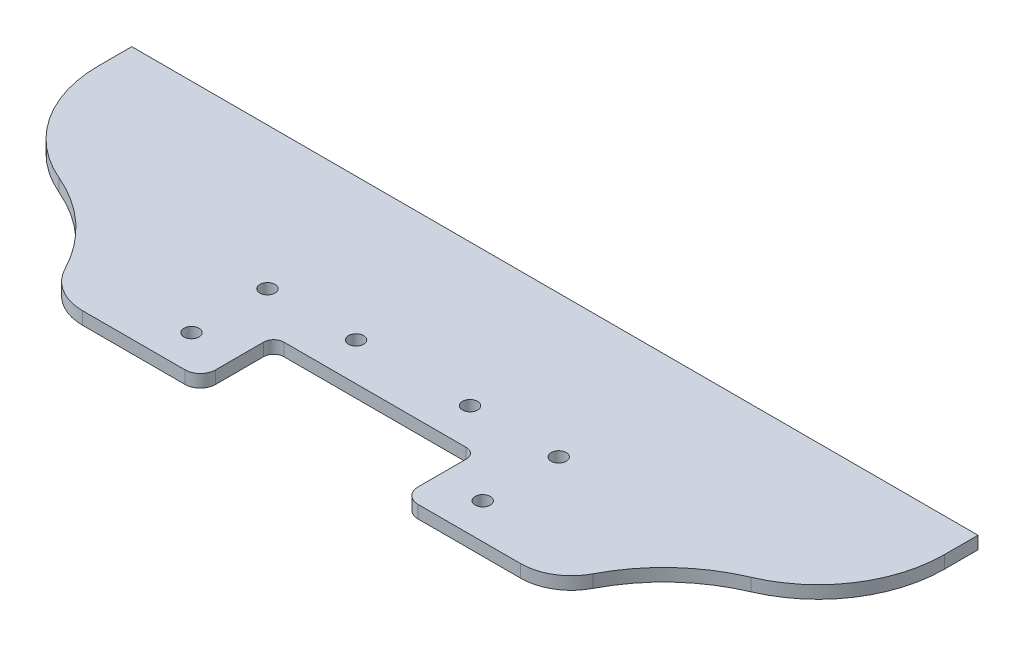
ISO-10303-21;
HEADER;
FILE_DESCRIPTION(('STEP AP214'),'2;1');
FILE_NAME('part.step','',(''),(''),'','','');
FILE_SCHEMA(('AUTOMOTIVE_DESIGN { 1 0 10303 214 1 1 1 1 }'));
ENDSEC;
DATA;
#1=APPLICATION_CONTEXT('core data for automotive mechanical design processes');
#2=APPLICATION_PROTOCOL_DEFINITION('international standard','automotive_design',2000,#1);
#3=PRODUCT_CONTEXT('',#1,'mechanical');
#4=PRODUCT('Part','Part','',(#3));
#5=PRODUCT_RELATED_PRODUCT_CATEGORY('part','',(#4));
#6=PRODUCT_DEFINITION_FORMATION('','',#4);
#7=PRODUCT_DEFINITION_CONTEXT('part definition',#1,'design');
#8=PRODUCT_DEFINITION('design','',#6,#7);
#9=PRODUCT_DEFINITION_SHAPE('','',#8);
#10=(LENGTH_UNIT() NAMED_UNIT(*) SI_UNIT(.MILLI.,.METRE.));
#11=(NAMED_UNIT(*) PLANE_ANGLE_UNIT() SI_UNIT($,.RADIAN.));
#12=(NAMED_UNIT(*) SI_UNIT($,.STERADIAN.) SOLID_ANGLE_UNIT());
#13=UNCERTAINTY_MEASURE_WITH_UNIT(LENGTH_MEASURE(1.E-05),#10,'distance_accuracy_value','');
#14=(GEOMETRIC_REPRESENTATION_CONTEXT(3) GLOBAL_UNCERTAINTY_ASSIGNED_CONTEXT((#13)) GLOBAL_UNIT_ASSIGNED_CONTEXT((#10,
#11,#12)) REPRESENTATION_CONTEXT('',''));
#15=CARTESIAN_POINT('',(0.,0.,0.));
#16=DIRECTION('',(0.,0.,1.));
#17=DIRECTION('',(1.,0.,0.));
#18=AXIS2_PLACEMENT_3D('',#15,#16,#17);
#19=CARTESIAN_POINT('',(-102.892624920902,3.175,35.5825031396323));
#20=DIRECTION('',(0.,-1.,0.));
#21=DIRECTION('',(0.,0.,-1.));
#22=AXIS2_PLACEMENT_3D('',#19,#20,#21);
#23=CYLINDRICAL_SURFACE('',#22,41.2975031396323);
#24=DIRECTION('',(0.,1.,0.));
#25=VECTOR('',#24,1.);
#26=CARTESIAN_POINT('',(-86.7504328122766,3.175,-2.4295133748354));
#27=LINE('',#26,#25);
#28=CARTESIAN_POINT('',(-86.7504328122766,0.,-2.4295133748354));
#29=VERTEX_POINT('',#28);
#30=CARTESIAN_POINT('',(-86.7504328122766,3.175,-2.4295133748354));
#31=VERTEX_POINT('',#30);
#32=EDGE_CURVE('E11',#29,#31,#27,.T.);
#33=ORIENTED_EDGE('',*,*,#32,.F.);
#34=CARTESIAN_POINT('',(-102.892624920902,0.,35.5825031396323));
#35=DIRECTION('',(0.,-1.,0.));
#36=DIRECTION('',(0.,0.,-1.));
#37=AXIS2_PLACEMENT_3D('',#34,#35,#36);
#38=CIRCLE('',#37,41.2975031396323);
#39=CARTESIAN_POINT('',(-66.2034722475201,0.,16.6249230810596));
#40=VERTEX_POINT('',#39);
#41=EDGE_CURVE('E135',#29,#40,#38,.T.);
#42=ORIENTED_EDGE('',*,*,#41,.T.);
#43=DIRECTION('',(0.,1.,0.));
#44=VECTOR('',#43,1.);
#45=CARTESIAN_POINT('',(-66.2034722475201,3.175,16.6249230810596));
#46=LINE('',#45,#44);
#47=CARTESIAN_POINT('',(-66.2034722475201,3.175,16.6249230810596));
#48=VERTEX_POINT('',#47);
#49=EDGE_CURVE('E48',#40,#48,#46,.T.);
#50=ORIENTED_EDGE('',*,*,#49,.T.);
#51=CARTESIAN_POINT('',(-102.892624920902,3.175,35.5825031396323));
#52=DIRECTION('',(0.,-1.,0.));
#53=DIRECTION('',(0.,0.,1.));
#54=AXIS2_PLACEMENT_3D('',#51,#52,#53);
#55=CIRCLE('',#54,41.2975031396323);
#56=EDGE_CURVE('E237',#31,#48,#55,.T.);
#57=ORIENTED_EDGE('',*,*,#56,.F.);
#58=EDGE_LOOP('',(#33,#42,#50,#57));
#59=FACE_BOUND('',#58,.T.);
#60=ADVANCED_FACE('F38',(#59),#23,.F.);
#61=CARTESIAN_POINT('',(-54.9206535895371,3.175,10.795));
#62=DIRECTION('',(0.,-1.,0.));
#63=DIRECTION('',(0.,0.,-1.));
#64=AXIS2_PLACEMENT_3D('',#61,#62,#63);
#65=CYLINDRICAL_SURFACE('',#64,12.7);
#66=ORIENTED_EDGE('',*,*,#49,.F.);
#67=CARTESIAN_POINT('',(-54.9206535895371,0.,10.795));
#68=DIRECTION('',(0.,-1.,0.));
#69=DIRECTION('',(0.,0.,-1.));
#70=AXIS2_PLACEMENT_3D('',#67,#68,#69);
#71=CIRCLE('',#70,12.7);
#72=CARTESIAN_POINT('',(-54.9206535895371,0.,23.495));
#73=VERTEX_POINT('',#72);
#74=EDGE_CURVE('E187',#40,#73,#71,.F.);
#75=ORIENTED_EDGE('',*,*,#74,.T.);
#76=DIRECTION('',(0.,1.,0.));
#77=VECTOR('',#76,1.);
#78=CARTESIAN_POINT('',(-54.9206535895371,3.175,23.495));
#79=LINE('',#78,#77);
#80=CARTESIAN_POINT('',(-54.9206535895371,3.175,23.495));
#81=VERTEX_POINT('',#80);
#82=EDGE_CURVE('E230',#73,#81,#79,.T.);
#83=ORIENTED_EDGE('',*,*,#82,.T.);
#84=CARTESIAN_POINT('',(-54.9206535895371,3.175,10.795));
#85=DIRECTION('',(0.,-1.,0.));
#86=DIRECTION('',(0.,0.,-1.));
#87=AXIS2_PLACEMENT_3D('',#84,#85,#86);
#88=CIRCLE('',#87,12.7);
#89=EDGE_CURVE('E246',#48,#81,#88,.F.);
#90=ORIENTED_EDGE('',*,*,#89,.F.);
#91=EDGE_LOOP('',(#66,#75,#83,#90));
#92=FACE_BOUND('',#91,.T.);
#93=ADVANCED_FACE('F249',(#92),#65,.T.);
#94=CARTESIAN_POINT('',(-104.775,3.175,23.495));
#95=DIRECTION('',(0.,0.,1.));
#96=DIRECTION('',(-1.,0.,0.));
#97=AXIS2_PLACEMENT_3D('',#94,#95,#96);
#98=PLANE('',#97);
#99=ORIENTED_EDGE('',*,*,#82,.F.);
#100=DIRECTION('',(1.,0.,0.));
#101=VECTOR('',#100,1.);
#102=CARTESIAN_POINT('',(0.,0.,23.495));
#103=LINE('',#102,#101);
#104=CARTESIAN_POINT('',(-29.21,0.,23.495));
#105=VERTEX_POINT('',#104);
#106=EDGE_CURVE('E184',#105,#73,#103,.F.);
#107=ORIENTED_EDGE('',*,*,#106,.F.);
#108=DIRECTION('',(0.,1.,0.));
#109=VECTOR('',#108,1.);
#110=CARTESIAN_POINT('',(-29.21,3.175,23.495));
#111=LINE('',#110,#109);
#112=CARTESIAN_POINT('',(-29.21,3.175,23.495));
#113=VERTEX_POINT('',#112);
#114=EDGE_CURVE('E227',#105,#113,#111,.T.);
#115=ORIENTED_EDGE('',*,*,#114,.T.);
#116=DIRECTION('',(-1.,0.,0.));
#117=VECTOR('',#116,1.);
#118=CARTESIAN_POINT('',(-104.775,3.175,23.495));
#119=LINE('',#118,#117);
#120=EDGE_CURVE('E250',#113,#81,#119,.T.);
#121=ORIENTED_EDGE('',*,*,#120,.T.);
#122=EDGE_LOOP('',(#99,#107,#115,#121));
#123=FACE_BOUND('',#122,.T.);
#124=ADVANCED_FACE('F327',(#123),#98,.T.);
#125=CARTESIAN_POINT('',(-29.21,3.175,19.685));
#126=DIRECTION('',(0.,-1.,0.));
#127=DIRECTION('',(0.,0.,-1.));
#128=AXIS2_PLACEMENT_3D('',#125,#126,#127);
#129=CYLINDRICAL_SURFACE('',#128,3.81);
#130=ORIENTED_EDGE('',*,*,#114,.F.);
#131=CARTESIAN_POINT('',(-29.21,0.,19.685));
#132=DIRECTION('',(0.,-1.,0.));
#133=DIRECTION('',(0.,0.,-1.));
#134=AXIS2_PLACEMENT_3D('',#131,#132,#133);
#135=CIRCLE('',#134,3.81);
#136=CARTESIAN_POINT('',(-25.4,0.,19.685));
#137=VERTEX_POINT('',#136);
#138=EDGE_CURVE('E181',#105,#137,#135,.F.);
#139=ORIENTED_EDGE('',*,*,#138,.T.);
#140=DIRECTION('',(0.,1.,0.));
#141=VECTOR('',#140,1.);
#142=CARTESIAN_POINT('',(-25.4,3.175,19.685));
#143=LINE('',#142,#141);
#144=CARTESIAN_POINT('',(-25.4,3.175,19.685));
#145=VERTEX_POINT('',#144);
#146=EDGE_CURVE('E224',#137,#145,#143,.T.);
#147=ORIENTED_EDGE('',*,*,#146,.T.);
#148=CARTESIAN_POINT('',(-29.21,3.175,19.685));
#149=DIRECTION('',(0.,-1.,0.));
#150=DIRECTION('',(0.,0.,-1.));
#151=AXIS2_PLACEMENT_3D('',#148,#149,#150);
#152=CIRCLE('',#151,3.81);
#153=EDGE_CURVE('E252',#113,#145,#152,.F.);
#154=ORIENTED_EDGE('',*,*,#153,.F.);
#155=EDGE_LOOP('',(#130,#139,#147,#154));
#156=FACE_BOUND('',#155,.T.);
#157=ADVANCED_FACE('F330',(#156),#129,.T.);
#158=CARTESIAN_POINT('',(-25.4,3.175,5.07999999999999));
#159=DIRECTION('',(1.,0.,0.));
#160=DIRECTION('',(0.,0.,1.));
#161=AXIS2_PLACEMENT_3D('',#158,#159,#160);
#162=PLANE('',#161);
#163=ORIENTED_EDGE('',*,*,#146,.F.);
#164=DIRECTION('',(0.,0.,-1.));
#165=VECTOR('',#164,1.);
#166=CARTESIAN_POINT('',(-25.4,0.,0.));
#167=LINE('',#166,#165);
#168=CARTESIAN_POINT('',(-25.4,0.,7.61999999999999));
#169=VERTEX_POINT('',#168);
#170=EDGE_CURVE('E178',#169,#137,#167,.F.);
#171=ORIENTED_EDGE('',*,*,#170,.F.);
#172=DIRECTION('',(0.,1.,0.));
#173=VECTOR('',#172,1.);
#174=CARTESIAN_POINT('',(-25.4,3.175,7.61999999999999));
#175=LINE('',#174,#173);
#176=CARTESIAN_POINT('',(-25.4,3.175,7.61999999999999));
#177=VERTEX_POINT('',#176);
#178=EDGE_CURVE('E221',#169,#177,#175,.T.);
#179=ORIENTED_EDGE('',*,*,#178,.T.);
#180=DIRECTION('',(0.,0.,1.));
#181=VECTOR('',#180,1.);
#182=CARTESIAN_POINT('',(-25.4,3.175,5.07999999999999));
#183=LINE('',#182,#181);
#184=EDGE_CURVE('E259',#177,#145,#183,.T.);
#185=ORIENTED_EDGE('',*,*,#184,.T.);
#186=EDGE_LOOP('',(#163,#171,#179,#185));
#187=FACE_BOUND('',#186,.T.);
#188=ADVANCED_FACE('F333',(#187),#162,.T.);
#189=CARTESIAN_POINT('',(-22.86,3.175,7.61999999999999));
#190=DIRECTION('',(0.,-1.,0.));
#191=DIRECTION('',(0.,0.,-1.));
#192=AXIS2_PLACEMENT_3D('',#189,#190,#191);
#193=CYLINDRICAL_SURFACE('',#192,2.54);
#194=ORIENTED_EDGE('',*,*,#178,.F.);
#195=CARTESIAN_POINT('',(-22.86,0.,7.61999999999999));
#196=DIRECTION('',(0.,-1.,0.));
#197=DIRECTION('',(0.,0.,-1.));
#198=AXIS2_PLACEMENT_3D('',#195,#196,#197);
#199=CIRCLE('',#198,2.54);
#200=CARTESIAN_POINT('',(-22.86,0.,5.07999999999999));
#201=VERTEX_POINT('',#200);
#202=EDGE_CURVE('E175',#169,#201,#199,.T.);
#203=ORIENTED_EDGE('',*,*,#202,.T.);
#204=DIRECTION('',(0.,1.,0.));
#205=VECTOR('',#204,1.);
#206=CARTESIAN_POINT('',(-22.86,3.175,5.07999999999999));
#207=LINE('',#206,#205);
#208=CARTESIAN_POINT('',(-22.86,3.175,5.07999999999999));
#209=VERTEX_POINT('',#208);
#210=EDGE_CURVE('E218',#201,#209,#207,.T.);
#211=ORIENTED_EDGE('',*,*,#210,.T.);
#212=CARTESIAN_POINT('',(-22.86,3.175,7.61999999999999));
#213=DIRECTION('',(0.,-1.,0.));
#214=DIRECTION('',(0.,0.,-1.));
#215=AXIS2_PLACEMENT_3D('',#212,#213,#214);
#216=CIRCLE('',#215,2.54);
#217=EDGE_CURVE('E262',#177,#209,#216,.T.);
#218=ORIENTED_EDGE('',*,*,#217,.F.);
#219=EDGE_LOOP('',(#194,#203,#211,#218));
#220=FACE_BOUND('',#219,.T.);
#221=ADVANCED_FACE('F337',(#220),#193,.F.);
#222=CARTESIAN_POINT('',(-25.4,3.175,5.07999999999999));
#223=DIRECTION('',(0.,0.,1.));
#224=DIRECTION('',(-1.,0.,0.));
#225=AXIS2_PLACEMENT_3D('',#222,#223,#224);
#226=PLANE('',#225);
#227=ORIENTED_EDGE('',*,*,#210,.F.);
#228=DIRECTION('',(1.,0.,0.));
#229=VECTOR('',#228,1.);
#230=CARTESIAN_POINT('',(0.,0.,5.07999999999999));
#231=LINE('',#230,#229);
#232=CARTESIAN_POINT('',(22.86,0.,5.07999999999999));
#233=VERTEX_POINT('',#232);
#234=EDGE_CURVE('E172',#233,#201,#231,.F.);
#235=ORIENTED_EDGE('',*,*,#234,.F.);
#236=DIRECTION('',(0.,1.,0.));
#237=VECTOR('',#236,1.);
#238=CARTESIAN_POINT('',(22.86,3.175,5.07999999999999));
#239=LINE('',#238,#237);
#240=CARTESIAN_POINT('',(22.86,3.175,5.07999999999999));
#241=VERTEX_POINT('',#240);
#242=EDGE_CURVE('E215',#233,#241,#239,.T.);
#243=ORIENTED_EDGE('',*,*,#242,.T.);
#244=DIRECTION('',(-1.,0.,0.));
#245=VECTOR('',#244,1.);
#246=CARTESIAN_POINT('',(-25.4,3.175,5.07999999999999));
#247=LINE('',#246,#245);
#248=EDGE_CURVE('E265',#241,#209,#247,.T.);
#249=ORIENTED_EDGE('',*,*,#248,.T.);
#250=EDGE_LOOP('',(#227,#235,#243,#249));
#251=FACE_BOUND('',#250,.T.);
#252=ADVANCED_FACE('F341',(#251),#226,.T.);
#253=CARTESIAN_POINT('',(22.86,3.175,7.61999999999999));
#254=DIRECTION('',(0.,-1.,0.));
#255=DIRECTION('',(0.,0.,-1.));
#256=AXIS2_PLACEMENT_3D('',#253,#254,#255);
#257=CYLINDRICAL_SURFACE('',#256,2.54);
#258=ORIENTED_EDGE('',*,*,#242,.F.);
#259=CARTESIAN_POINT('',(22.86,0.,7.61999999999999));
#260=DIRECTION('',(0.,-1.,0.));
#261=DIRECTION('',(0.,0.,-1.));
#262=AXIS2_PLACEMENT_3D('',#259,#260,#261);
#263=CIRCLE('',#262,2.54);
#264=CARTESIAN_POINT('',(25.4,0.,7.61999999999999));
#265=VERTEX_POINT('',#264);
#266=EDGE_CURVE('E169',#233,#265,#263,.T.);
#267=ORIENTED_EDGE('',*,*,#266,.T.);
#268=DIRECTION('',(0.,1.,0.));
#269=VECTOR('',#268,1.);
#270=CARTESIAN_POINT('',(25.4,3.175,7.61999999999999));
#271=LINE('',#270,#269);
#272=CARTESIAN_POINT('',(25.4,3.175,7.61999999999999));
#273=VERTEX_POINT('',#272);
#274=EDGE_CURVE('E212',#265,#273,#271,.T.);
#275=ORIENTED_EDGE('',*,*,#274,.T.);
#276=CARTESIAN_POINT('',(22.86,3.175,7.61999999999999));
#277=DIRECTION('',(0.,-1.,0.));
#278=DIRECTION('',(0.,0.,-1.));
#279=AXIS2_PLACEMENT_3D('',#276,#277,#278);
#280=CIRCLE('',#279,2.54);
#281=EDGE_CURVE('E268',#241,#273,#280,.T.);
#282=ORIENTED_EDGE('',*,*,#281,.F.);
#283=EDGE_LOOP('',(#258,#267,#275,#282));
#284=FACE_BOUND('',#283,.T.);
#285=ADVANCED_FACE('F345',(#284),#257,.F.);
#286=CARTESIAN_POINT('',(25.4,3.175,5.07999999999999));
#287=DIRECTION('',(-1.,0.,0.));
#288=DIRECTION('',(0.,0.,-1.));
#289=AXIS2_PLACEMENT_3D('',#286,#287,#288);
#290=PLANE('',#289);
#291=ORIENTED_EDGE('',*,*,#274,.F.);
#292=DIRECTION('',(0.,0.,-1.));
#293=VECTOR('',#292,1.);
#294=CARTESIAN_POINT('',(25.4,0.,0.));
#295=LINE('',#294,#293);
#296=CARTESIAN_POINT('',(25.4,0.,19.685));
#297=VERTEX_POINT('',#296);
#298=EDGE_CURVE('E166',#297,#265,#295,.T.);
#299=ORIENTED_EDGE('',*,*,#298,.F.);
#300=DIRECTION('',(0.,1.,0.));
#301=VECTOR('',#300,1.);
#302=CARTESIAN_POINT('',(25.4,3.175,19.685));
#303=LINE('',#302,#301);
#304=CARTESIAN_POINT('',(25.4,3.175,19.685));
#305=VERTEX_POINT('',#304);
#306=EDGE_CURVE('E209',#297,#305,#303,.T.);
#307=ORIENTED_EDGE('',*,*,#306,.T.);
#308=DIRECTION('',(0.,0.,-1.));
#309=VECTOR('',#308,1.);
#310=CARTESIAN_POINT('',(25.4,3.175,5.07999999999999));
#311=LINE('',#310,#309);
#312=EDGE_CURVE('E271',#305,#273,#311,.T.);
#313=ORIENTED_EDGE('',*,*,#312,.T.);
#314=EDGE_LOOP('',(#291,#299,#307,#313));
#315=FACE_BOUND('',#314,.T.);
#316=ADVANCED_FACE('F349',(#315),#290,.T.);
#317=CARTESIAN_POINT('',(29.21,3.175,19.685));
#318=DIRECTION('',(0.,-1.,0.));
#319=DIRECTION('',(0.,0.,-1.));
#320=AXIS2_PLACEMENT_3D('',#317,#318,#319);
#321=CYLINDRICAL_SURFACE('',#320,3.81);
#322=ORIENTED_EDGE('',*,*,#306,.F.);
#323=CARTESIAN_POINT('',(29.21,0.,19.685));
#324=DIRECTION('',(0.,-1.,0.));
#325=DIRECTION('',(0.,0.,-1.));
#326=AXIS2_PLACEMENT_3D('',#323,#324,#325);
#327=CIRCLE('',#326,3.81);
#328=CARTESIAN_POINT('',(29.21,0.,23.495));
#329=VERTEX_POINT('',#328);
#330=EDGE_CURVE('E163',#297,#329,#327,.F.);
#331=ORIENTED_EDGE('',*,*,#330,.T.);
#332=DIRECTION('',(0.,1.,0.));
#333=VECTOR('',#332,1.);
#334=CARTESIAN_POINT('',(29.21,3.175,23.495));
#335=LINE('',#334,#333);
#336=CARTESIAN_POINT('',(29.21,3.175,23.495));
#337=VERTEX_POINT('',#336);
#338=EDGE_CURVE('E206',#329,#337,#335,.T.);
#339=ORIENTED_EDGE('',*,*,#338,.T.);
#340=CARTESIAN_POINT('',(29.21,3.175,19.685));
#341=DIRECTION('',(0.,-1.,0.));
#342=DIRECTION('',(0.,0.,-1.));
#343=AXIS2_PLACEMENT_3D('',#340,#341,#342);
#344=CIRCLE('',#343,3.81);
#345=EDGE_CURVE('E274',#305,#337,#344,.F.);
#346=ORIENTED_EDGE('',*,*,#345,.F.);
#347=EDGE_LOOP('',(#322,#331,#339,#346));
#348=FACE_BOUND('',#347,.T.);
#349=ADVANCED_FACE('F353',(#348),#321,.T.);
#350=ORIENTED_EDGE('',*,*,#338,.F.);
#351=DIRECTION('',(1.,0.,0.));
#352=VECTOR('',#351,1.);
#353=CARTESIAN_POINT('',(0.,0.,23.495));
#354=LINE('',#353,#352);
#355=CARTESIAN_POINT('',(54.9206535895371,0.,23.495));
#356=VERTEX_POINT('',#355);
#357=EDGE_CURVE('E160',#356,#329,#354,.F.);
#358=ORIENTED_EDGE('',*,*,#357,.F.);
#359=DIRECTION('',(0.,1.,0.));
#360=VECTOR('',#359,1.);
#361=CARTESIAN_POINT('',(54.9206535895371,3.175,23.495));
#362=LINE('',#361,#360);
#363=CARTESIAN_POINT('',(54.9206535895371,3.175,23.495));
#364=VERTEX_POINT('',#363);
#365=EDGE_CURVE('E203',#356,#364,#362,.T.);
#366=ORIENTED_EDGE('',*,*,#365,.T.);
#367=EDGE_CURVE('E254',#364,#337,#119,.T.);
#368=ORIENTED_EDGE('',*,*,#367,.T.);
#369=EDGE_LOOP('',(#350,#358,#366,#368));
#370=FACE_BOUND('',#369,.T.);
#371=ADVANCED_FACE('F357',(#370),#98,.T.);
#372=CARTESIAN_POINT('',(54.9206535895371,3.175,10.795));
#373=DIRECTION('',(0.,-1.,0.));
#374=DIRECTION('',(0.,0.,-1.));
#375=AXIS2_PLACEMENT_3D('',#372,#373,#374);
#376=CYLINDRICAL_SURFACE('',#375,12.7);
#377=ORIENTED_EDGE('',*,*,#365,.F.);
#378=CARTESIAN_POINT('',(54.9206535895371,0.,10.795));
#379=DIRECTION('',(0.,-1.,0.));
#380=DIRECTION('',(0.,0.,-1.));
#381=AXIS2_PLACEMENT_3D('',#378,#379,#380);
#382=CIRCLE('',#381,12.7);
#383=CARTESIAN_POINT('',(66.2034722475201,0.,16.6249230810596));
#384=VERTEX_POINT('',#383);
#385=EDGE_CURVE('E157',#356,#384,#382,.F.);
#386=ORIENTED_EDGE('',*,*,#385,.T.);
#387=DIRECTION('',(0.,1.,0.));
#388=VECTOR('',#387,1.);
#389=CARTESIAN_POINT('',(66.2034722475201,3.175,16.6249230810596));
#390=LINE('',#389,#388);
#391=CARTESIAN_POINT('',(66.2034722475201,3.175,16.6249230810596));
#392=VERTEX_POINT('',#391);
#393=EDGE_CURVE('E200',#384,#392,#390,.T.);
#394=ORIENTED_EDGE('',*,*,#393,.T.);
#395=CARTESIAN_POINT('',(54.9206535895371,3.175,10.795));
#396=DIRECTION('',(0.,-1.,0.));
#397=DIRECTION('',(0.,0.,-1.));
#398=AXIS2_PLACEMENT_3D('',#395,#396,#397);
#399=CIRCLE('',#398,12.7);
#400=EDGE_CURVE('E277',#364,#392,#399,.F.);
#401=ORIENTED_EDGE('',*,*,#400,.F.);
#402=EDGE_LOOP('',(#377,#386,#394,#401));
#403=FACE_BOUND('',#402,.T.);
#404=ADVANCED_FACE('F361',(#403),#376,.T.);
#405=CARTESIAN_POINT('',(102.892624920902,3.175,35.5825031396323));
#406=DIRECTION('',(0.,-1.,0.));
#407=DIRECTION('',(0.,0.,-1.));
#408=AXIS2_PLACEMENT_3D('',#405,#406,#407);
#409=CYLINDRICAL_SURFACE('',#408,41.2975031396323);
#410=ORIENTED_EDGE('',*,*,#393,.F.);
#411=CARTESIAN_POINT('',(102.892624920902,0.,35.5825031396323));
#412=DIRECTION('',(0.,1.,0.));
#413=DIRECTION('',(0.,0.,1.));
#414=AXIS2_PLACEMENT_3D('',#411,#412,#413);
#415=CIRCLE('',#414,41.2975031396323);
#416=CARTESIAN_POINT('',(86.7504328122766,0.,-2.4295133748354));
#417=VERTEX_POINT('',#416);
#418=EDGE_CURVE('E154',#417,#384,#415,.T.);
#419=ORIENTED_EDGE('',*,*,#418,.F.);
#420=DIRECTION('',(0.,1.,0.));
#421=VECTOR('',#420,1.);
#422=CARTESIAN_POINT('',(86.7504328122766,3.175,-2.4295133748354));
#423=LINE('',#422,#421);
#424=CARTESIAN_POINT('',(86.7504328122766,3.175,-2.4295133748354));
#425=VERTEX_POINT('',#424);
#426=EDGE_CURVE('E197',#417,#425,#423,.T.);
#427=ORIENTED_EDGE('',*,*,#426,.T.);
#428=CARTESIAN_POINT('',(102.892624920902,3.175,35.5825031396323));
#429=DIRECTION('',(0.,1.,0.));
#430=DIRECTION('',(0.,0.,1.));
#431=AXIS2_PLACEMENT_3D('',#428,#429,#430);
#432=CIRCLE('',#431,41.2975031396323);
#433=EDGE_CURVE('E280',#425,#392,#432,.T.);
#434=ORIENTED_EDGE('',*,*,#433,.T.);
#435=EDGE_LOOP('',(#410,#419,#427,#434));
#436=FACE_BOUND('',#435,.T.);
#437=ADVANCED_FACE('F365',(#436),#409,.F.);
#438=CARTESIAN_POINT('',(74.3401280605345,3.175,-31.6535931031842));
#439=DIRECTION('',(0.,-1.,0.));
#440=DIRECTION('',(0.,0.,-1.));
#441=AXIS2_PLACEMENT_3D('',#438,#439,#440);
#442=CYLINDRICAL_SURFACE('',#441,31.75);
#443=ORIENTED_EDGE('',*,*,#426,.F.);
#444=CARTESIAN_POINT('',(74.3401280605345,0.,-31.6535931031842));
#445=DIRECTION('',(0.,-1.,0.));
#446=DIRECTION('',(0.,0.,-1.));
#447=AXIS2_PLACEMENT_3D('',#444,#445,#446);
#448=CIRCLE('',#447,31.75);
#449=CARTESIAN_POINT('',(106.090128060535,0.,-31.6535931031842));
#450=VERTEX_POINT('',#449);
#451=EDGE_CURVE('E151',#417,#450,#448,.F.);
#452=ORIENTED_EDGE('',*,*,#451,.T.);
#453=DIRECTION('',(0.,1.,0.));
#454=VECTOR('',#453,1.);
#455=CARTESIAN_POINT('',(106.090128060535,3.175,-31.6535931031842));
#456=LINE('',#455,#454);
#457=CARTESIAN_POINT('',(106.090128060535,3.175,-31.6535931031842));
#458=VERTEX_POINT('',#457);
#459=EDGE_CURVE('E194',#450,#458,#456,.T.);
#460=ORIENTED_EDGE('',*,*,#459,.T.);
#461=CARTESIAN_POINT('',(74.3401280605345,3.175,-31.6535931031842));
#462=DIRECTION('',(0.,-1.,0.));
#463=DIRECTION('',(0.,0.,-1.));
#464=AXIS2_PLACEMENT_3D('',#461,#462,#463);
#465=CIRCLE('',#464,31.75);
#466=EDGE_CURVE('E283',#425,#458,#465,.F.);
#467=ORIENTED_EDGE('',*,*,#466,.F.);
#468=EDGE_LOOP('',(#443,#452,#460,#467));
#469=FACE_BOUND('',#468,.T.);
#470=ADVANCED_FACE('F369',(#469),#442,.T.);
#471=CARTESIAN_POINT('',(106.090128060535,3.175,23.495));
#472=DIRECTION('',(-1.,0.,0.));
#473=DIRECTION('',(0.,0.,-1.));
#474=AXIS2_PLACEMENT_3D('',#471,#472,#473);
#475=PLANE('',#474);
#476=ORIENTED_EDGE('',*,*,#459,.F.);
#477=DIRECTION('',(0.,0.,-1.));
#478=VECTOR('',#477,1.);
#479=CARTESIAN_POINT('',(106.090128060535,0.,0.));
#480=LINE('',#479,#478);
#481=CARTESIAN_POINT('',(106.090128060535,0.,-40.005));
#482=VERTEX_POINT('',#481);
#483=EDGE_CURVE('E148',#450,#482,#480,.T.);
#484=ORIENTED_EDGE('',*,*,#483,.T.);
#485=DIRECTION('',(0.,1.,0.));
#486=VECTOR('',#485,1.);
#487=CARTESIAN_POINT('',(106.090128060535,3.175,-40.005));
#488=LINE('',#487,#486);
#489=CARTESIAN_POINT('',(106.090128060535,3.175,-40.005));
#490=VERTEX_POINT('',#489);
#491=EDGE_CURVE('E192',#482,#490,#488,.T.);
#492=ORIENTED_EDGE('',*,*,#491,.T.);
#493=DIRECTION('',(0.,0.,-1.));
#494=VECTOR('',#493,1.);
#495=CARTESIAN_POINT('',(106.090128060535,3.175,23.495));
#496=LINE('',#495,#494);
#497=EDGE_CURVE('E286',#458,#490,#496,.T.);
#498=ORIENTED_EDGE('',*,*,#497,.F.);
#499=EDGE_LOOP('',(#476,#484,#492,#498));
#500=FACE_BOUND('',#499,.T.);
#501=ADVANCED_FACE('F373',(#500),#475,.F.);
#502=CARTESIAN_POINT('',(-104.775,3.175,-40.005));
#503=DIRECTION('',(0.,0.,1.));
#504=DIRECTION('',(-1.,0.,0.));
#505=AXIS2_PLACEMENT_3D('',#502,#503,#504);
#506=PLANE('',#505);
#507=ORIENTED_EDGE('',*,*,#491,.F.);
#508=DIRECTION('',(1.,0.,0.));
#509=VECTOR('',#508,1.);
#510=CARTESIAN_POINT('',(0.,0.,-40.005));
#511=LINE('',#510,#509);
#512=CARTESIAN_POINT('',(-106.090128060535,0.,-40.005));
#513=VERTEX_POINT('',#512);
#514=EDGE_CURVE('E145',#482,#513,#511,.F.);
#515=ORIENTED_EDGE('',*,*,#514,.T.);
#516=DIRECTION('',(0.,1.,0.));
#517=VECTOR('',#516,1.);
#518=CARTESIAN_POINT('',(-106.090128060535,3.175,-40.005));
#519=LINE('',#518,#517);
#520=CARTESIAN_POINT('',(-106.090128060535,3.175,-40.005));
#521=VERTEX_POINT('',#520);
#522=EDGE_CURVE('E56',#513,#521,#519,.T.);
#523=ORIENTED_EDGE('',*,*,#522,.T.);
#524=DIRECTION('',(-1.,0.,0.));
#525=VECTOR('',#524,1.);
#526=CARTESIAN_POINT('',(-104.775,3.175,-40.005));
#527=LINE('',#526,#525);
#528=EDGE_CURVE('E128',#490,#521,#527,.T.);
#529=ORIENTED_EDGE('',*,*,#528,.F.);
#530=EDGE_LOOP('',(#507,#515,#523,#529));
#531=FACE_BOUND('',#530,.T.);
#532=ADVANCED_FACE('F377',(#531),#506,.F.);
#533=CARTESIAN_POINT('',(-106.090128060535,3.175,23.495));
#534=DIRECTION('',(-1.,0.,0.));
#535=DIRECTION('',(0.,0.,-1.));
#536=AXIS2_PLACEMENT_3D('',#533,#534,#535);
#537=PLANE('',#536);
#538=ORIENTED_EDGE('',*,*,#522,.F.);
#539=DIRECTION('',(0.,0.,-1.));
#540=VECTOR('',#539,1.);
#541=CARTESIAN_POINT('',(-106.090128060535,0.,0.));
#542=LINE('',#541,#540);
#543=CARTESIAN_POINT('',(-106.090128060535,0.,-31.6535931031842));
#544=VERTEX_POINT('',#543);
#545=EDGE_CURVE('E133',#544,#513,#542,.T.);
#546=ORIENTED_EDGE('',*,*,#545,.F.);
#547=DIRECTION('',(0.,1.,0.));
#548=VECTOR('',#547,1.);
#549=CARTESIAN_POINT('',(-106.090128060535,3.175,-31.6535931031842));
#550=LINE('',#549,#548);
#551=CARTESIAN_POINT('',(-106.090128060535,3.175,-31.6535931031842));
#552=VERTEX_POINT('',#551);
#553=EDGE_CURVE('E42',#544,#552,#550,.T.);
#554=ORIENTED_EDGE('',*,*,#553,.T.);
#555=DIRECTION('',(0.,0.,-1.));
#556=VECTOR('',#555,1.);
#557=CARTESIAN_POINT('',(-106.090128060535,3.175,23.495));
#558=LINE('',#557,#556);
#559=EDGE_CURVE('E442',#552,#521,#558,.T.);
#560=ORIENTED_EDGE('',*,*,#559,.T.);
#561=EDGE_LOOP('',(#538,#546,#554,#560));
#562=FACE_BOUND('',#561,.T.);
#563=ADVANCED_FACE('F137',(#562),#537,.T.);
#564=CARTESIAN_POINT('',(36.5125,3.175,14.605));
#565=DIRECTION('',(0.,-1.,0.));
#566=DIRECTION('',(0.,0.,-1.));
#567=AXIS2_PLACEMENT_3D('',#564,#565,#566);
#568=CYLINDRICAL_SURFACE('',#567,1.89865);
#569=CARTESIAN_POINT('',(36.5125,3.175,14.605));
#570=DIRECTION('',(0.,1.,0.));
#571=DIRECTION('',(0.,0.,1.));
#572=AXIS2_PLACEMENT_3D('',#569,#570,#571);
#573=CIRCLE('',#572,1.89865);
#574=CARTESIAN_POINT('',(36.5125,3.175,16.50365));
#575=VERTEX_POINT('',#574);
#576=EDGE_CURVE('E147',#575,#575,#573,.T.);
#577=ORIENTED_EDGE('',*,*,#576,.T.);
#578=EDGE_LOOP('',(#577));
#579=FACE_BOUND('',#578,.T.);
#580=CARTESIAN_POINT('',(36.5125,0.,14.605));
#581=DIRECTION('',(0.,1.,0.));
#582=DIRECTION('',(0.,0.,1.));
#583=AXIS2_PLACEMENT_3D('',#580,#581,#582);
#584=CIRCLE('',#583,1.89865);
#585=CARTESIAN_POINT('',(36.5125,0.,16.50365));
#586=VERTEX_POINT('',#585);
#587=EDGE_CURVE('E291',#586,#586,#584,.T.);
#588=ORIENTED_EDGE('',*,*,#587,.F.);
#589=EDGE_LOOP('',(#588));
#590=FACE_BOUND('',#589,.T.);
#591=ADVANCED_FACE('F382',(#579,#590),#568,.F.);
#592=CARTESIAN_POINT('',(-36.5125,3.175,-4.44500000000002));
#593=DIRECTION('',(0.,-1.,0.));
#594=DIRECTION('',(0.,0.,-1.));
#595=AXIS2_PLACEMENT_3D('',#592,#593,#594);
#596=CYLINDRICAL_SURFACE('',#595,1.89865);
#597=CARTESIAN_POINT('',(-36.5125,3.175,-4.44500000000002));
#598=DIRECTION('',(0.,1.,0.));
#599=DIRECTION('',(0.,0.,1.));
#600=AXIS2_PLACEMENT_3D('',#597,#598,#599);
#601=CIRCLE('',#600,1.89865);
#602=CARTESIAN_POINT('',(-36.5125,3.175,-2.54635000000002));
#603=VERTEX_POINT('',#602);
#604=EDGE_CURVE('E430',#603,#603,#601,.T.);
#605=ORIENTED_EDGE('',*,*,#604,.T.);
#606=EDGE_LOOP('',(#605));
#607=FACE_BOUND('',#606,.T.);
#608=CARTESIAN_POINT('',(-36.5125,0.,-4.44500000000002));
#609=DIRECTION('',(0.,1.,0.));
#610=DIRECTION('',(0.,0.,1.));
#611=AXIS2_PLACEMENT_3D('',#608,#609,#610);
#612=CIRCLE('',#611,1.89865);
#613=CARTESIAN_POINT('',(-36.5125,0.,-2.54635000000002));
#614=VERTEX_POINT('',#613);
#615=EDGE_CURVE('E294',#614,#614,#612,.T.);
#616=ORIENTED_EDGE('',*,*,#615,.F.);
#617=EDGE_LOOP('',(#616));
#618=FACE_BOUND('',#617,.T.);
#619=ADVANCED_FACE('F386',(#607,#618),#596,.F.);
#620=CARTESIAN_POINT('',(-14.2875,3.175,-4.44500000000001));
#621=DIRECTION('',(0.,-1.,0.));
#622=DIRECTION('',(0.,0.,-1.));
#623=AXIS2_PLACEMENT_3D('',#620,#621,#622);
#624=CYLINDRICAL_SURFACE('',#623,1.89865);
#625=CARTESIAN_POINT('',(-14.2875,3.175,-4.44500000000001));
#626=DIRECTION('',(0.,1.,0.));
#627=DIRECTION('',(0.,0.,1.));
#628=AXIS2_PLACEMENT_3D('',#625,#626,#627);
#629=CIRCLE('',#628,1.89865);
#630=CARTESIAN_POINT('',(-14.2875,3.175,-2.54635000000001));
#631=VERTEX_POINT('',#630);
#632=EDGE_CURVE('E406',#631,#631,#629,.T.);
#633=ORIENTED_EDGE('',*,*,#632,.T.);
#634=EDGE_LOOP('',(#633));
#635=FACE_BOUND('',#634,.T.);
#636=CARTESIAN_POINT('',(-14.2875,0.,-4.44500000000001));
#637=DIRECTION('',(0.,1.,0.));
#638=DIRECTION('',(0.,0.,1.));
#639=AXIS2_PLACEMENT_3D('',#636,#637,#638);
#640=CIRCLE('',#639,1.89865);
#641=CARTESIAN_POINT('',(-14.2875,0.,-2.54635000000001));
#642=VERTEX_POINT('',#641);
#643=EDGE_CURVE('E297',#642,#642,#640,.T.);
#644=ORIENTED_EDGE('',*,*,#643,.F.);
#645=EDGE_LOOP('',(#644));
#646=FACE_BOUND('',#645,.T.);
#647=ADVANCED_FACE('F319',(#635,#646),#624,.F.);
#648=CARTESIAN_POINT('',(14.2875,3.175,-4.44500000000001));
#649=DIRECTION('',(0.,-1.,0.));
#650=DIRECTION('',(0.,0.,-1.));
#651=AXIS2_PLACEMENT_3D('',#648,#649,#650);
#652=CYLINDRICAL_SURFACE('',#651,1.89865);
#653=CARTESIAN_POINT('',(14.2875,3.175,-4.44500000000001));
#654=DIRECTION('',(0.,1.,0.));
#655=DIRECTION('',(0.,0.,1.));
#656=AXIS2_PLACEMENT_3D('',#653,#654,#655);
#657=CIRCLE('',#656,1.89865);
#658=CARTESIAN_POINT('',(14.2875,3.175,-2.54635000000001));
#659=VERTEX_POINT('',#658);
#660=EDGE_CURVE('E435',#659,#659,#657,.T.);
#661=ORIENTED_EDGE('',*,*,#660,.T.);
#662=EDGE_LOOP('',(#661));
#663=FACE_BOUND('',#662,.T.);
#664=CARTESIAN_POINT('',(14.2875,0.,-4.44500000000001));
#665=DIRECTION('',(0.,1.,0.));
#666=DIRECTION('',(0.,0.,1.));
#667=AXIS2_PLACEMENT_3D('',#664,#665,#666);
#668=CIRCLE('',#667,1.89865);
#669=CARTESIAN_POINT('',(14.2875,0.,-2.54635000000001));
#670=VERTEX_POINT('',#669);
#671=EDGE_CURVE('E300',#670,#670,#668,.T.);
#672=ORIENTED_EDGE('',*,*,#671,.F.);
#673=EDGE_LOOP('',(#672));
#674=FACE_BOUND('',#673,.T.);
#675=ADVANCED_FACE('F310',(#663,#674),#652,.F.);
#676=CARTESIAN_POINT('',(-36.5125,3.175,14.605));
#677=DIRECTION('',(0.,-1.,0.));
#678=DIRECTION('',(0.,0.,-1.));
#679=AXIS2_PLACEMENT_3D('',#676,#677,#678);
#680=CYLINDRICAL_SURFACE('',#679,1.89865);
#681=CARTESIAN_POINT('',(-36.5125,3.175,14.605));
#682=DIRECTION('',(0.,1.,0.));
#683=DIRECTION('',(0.,0.,1.));
#684=AXIS2_PLACEMENT_3D('',#681,#682,#683);
#685=CIRCLE('',#684,1.89865);
#686=CARTESIAN_POINT('',(-36.5125,3.175,16.50365));
#687=VERTEX_POINT('',#686);
#688=EDGE_CURVE('E438',#687,#687,#685,.T.);
#689=ORIENTED_EDGE('',*,*,#688,.T.);
#690=EDGE_LOOP('',(#689));
#691=FACE_BOUND('',#690,.T.);
#692=CARTESIAN_POINT('',(-36.5125,0.,14.605));
#693=DIRECTION('',(0.,1.,0.));
#694=DIRECTION('',(0.,0.,1.));
#695=AXIS2_PLACEMENT_3D('',#692,#693,#694);
#696=CIRCLE('',#695,1.89865);
#697=CARTESIAN_POINT('',(-36.5125,0.,16.50365));
#698=VERTEX_POINT('',#697);
#699=EDGE_CURVE('E141',#698,#698,#696,.T.);
#700=ORIENTED_EDGE('',*,*,#699,.F.);
#701=EDGE_LOOP('',(#700));
#702=FACE_BOUND('',#701,.T.);
#703=ADVANCED_FACE('F307',(#691,#702),#680,.F.);
#704=CARTESIAN_POINT('',(36.5125,3.175,-4.44500000000003));
#705=DIRECTION('',(0.,-1.,0.));
#706=DIRECTION('',(0.,0.,-1.));
#707=AXIS2_PLACEMENT_3D('',#704,#705,#706);
#708=CYLINDRICAL_SURFACE('',#707,1.89865);
#709=CARTESIAN_POINT('',(36.5125,3.175,-4.44500000000003));
#710=DIRECTION('',(0.,1.,0.));
#711=DIRECTION('',(0.,0.,1.));
#712=AXIS2_PLACEMENT_3D('',#709,#710,#711);
#713=CIRCLE('',#712,1.89865);
#714=CARTESIAN_POINT('',(36.5125,3.175,-2.54635000000003));
#715=VERTEX_POINT('',#714);
#716=EDGE_CURVE('E441',#715,#715,#713,.T.);
#717=ORIENTED_EDGE('',*,*,#716,.T.);
#718=EDGE_LOOP('',(#717));
#719=FACE_BOUND('',#718,.T.);
#720=CARTESIAN_POINT('',(36.5125,0.,-4.44500000000003));
#721=DIRECTION('',(0.,1.,0.));
#722=DIRECTION('',(0.,0.,1.));
#723=AXIS2_PLACEMENT_3D('',#720,#721,#722);
#724=CIRCLE('',#723,1.89865);
#725=CARTESIAN_POINT('',(36.5125,0.,-2.54635000000003));
#726=VERTEX_POINT('',#725);
#727=EDGE_CURVE('E138',#726,#726,#724,.T.);
#728=ORIENTED_EDGE('',*,*,#727,.F.);
#729=EDGE_LOOP('',(#728));
#730=FACE_BOUND('',#729,.T.);
#731=ADVANCED_FACE('F309',(#719,#730),#708,.F.);
#732=CARTESIAN_POINT('',(-74.3401280605345,3.175,-31.6535931031842));
#733=DIRECTION('',(0.,-1.,0.));
#734=DIRECTION('',(0.,0.,-1.));
#735=AXIS2_PLACEMENT_3D('',#732,#733,#734);
#736=CYLINDRICAL_SURFACE('',#735,31.75);
#737=CARTESIAN_POINT('',(-74.3401280605345,0.,-31.6535931031842));
#738=DIRECTION('',(0.,-1.,0.));
#739=DIRECTION('',(0.,0.,-1.));
#740=AXIS2_PLACEMENT_3D('',#737,#738,#739);
#741=CIRCLE('',#740,31.75);
#742=EDGE_CURVE('E122',#544,#29,#741,.F.);
#743=ORIENTED_EDGE('',*,*,#742,.T.);
#744=ORIENTED_EDGE('',*,*,#32,.T.);
#745=CARTESIAN_POINT('',(-74.3401280605345,3.175,-31.6535931031842));
#746=DIRECTION('',(0.,-1.,0.));
#747=DIRECTION('',(0.,0.,-1.));
#748=AXIS2_PLACEMENT_3D('',#745,#746,#747);
#749=CIRCLE('',#748,31.75);
#750=EDGE_CURVE('E124',#552,#31,#749,.F.);
#751=ORIENTED_EDGE('',*,*,#750,.F.);
#752=ORIENTED_EDGE('',*,*,#553,.F.);
#753=EDGE_LOOP('',(#743,#744,#751,#752));
#754=FACE_BOUND('',#753,.T.);
#755=ADVANCED_FACE('F40',(#754),#736,.T.);
#756=CARTESIAN_POINT('',(0.,3.175,0.));
#757=DIRECTION('',(0.,-1.,0.));
#758=DIRECTION('',(0.,0.,-1.));
#759=AXIS2_PLACEMENT_3D('',#756,#757,#758);
#760=PLANE('',#759);
#761=ORIENTED_EDGE('',*,*,#576,.F.);
#762=EDGE_LOOP('',(#761));
#763=FACE_BOUND('',#762,.T.);
#764=ORIENTED_EDGE('',*,*,#604,.F.);
#765=EDGE_LOOP('',(#764));
#766=FACE_BOUND('',#765,.T.);
#767=ORIENTED_EDGE('',*,*,#632,.F.);
#768=EDGE_LOOP('',(#767));
#769=FACE_BOUND('',#768,.T.);
#770=ORIENTED_EDGE('',*,*,#660,.F.);
#771=EDGE_LOOP('',(#770));
#772=FACE_BOUND('',#771,.T.);
#773=ORIENTED_EDGE('',*,*,#688,.F.);
#774=EDGE_LOOP('',(#773));
#775=FACE_BOUND('',#774,.T.);
#776=ORIENTED_EDGE('',*,*,#716,.F.);
#777=EDGE_LOOP('',(#776));
#778=FACE_BOUND('',#777,.T.);
#779=ORIENTED_EDGE('',*,*,#559,.F.);
#780=ORIENTED_EDGE('',*,*,#750,.T.);
#781=ORIENTED_EDGE('',*,*,#56,.T.);
#782=ORIENTED_EDGE('',*,*,#89,.T.);
#783=ORIENTED_EDGE('',*,*,#120,.F.);
#784=ORIENTED_EDGE('',*,*,#153,.T.);
#785=ORIENTED_EDGE('',*,*,#184,.F.);
#786=ORIENTED_EDGE('',*,*,#217,.T.);
#787=ORIENTED_EDGE('',*,*,#248,.F.);
#788=ORIENTED_EDGE('',*,*,#281,.T.);
#789=ORIENTED_EDGE('',*,*,#312,.F.);
#790=ORIENTED_EDGE('',*,*,#345,.T.);
#791=ORIENTED_EDGE('',*,*,#367,.F.);
#792=ORIENTED_EDGE('',*,*,#400,.T.);
#793=ORIENTED_EDGE('',*,*,#433,.F.);
#794=ORIENTED_EDGE('',*,*,#466,.T.);
#795=ORIENTED_EDGE('',*,*,#497,.T.);
#796=ORIENTED_EDGE('',*,*,#528,.T.);
#797=EDGE_LOOP('',(#779,#780,#781,#782,#783,#784,#785,#786,#787,#788,#789,#790,#791,#792,#793,
#794,#795,#796));
#798=FACE_BOUND('',#797,.T.);
#799=ADVANCED_FACE('F244',(#763,#766,#769,#772,#775,#778,#798),#760,.F.);
#800=CARTESIAN_POINT('',(0.,0.,0.));
#801=DIRECTION('',(0.,-1.,0.));
#802=DIRECTION('',(0.,0.,-1.));
#803=AXIS2_PLACEMENT_3D('',#800,#801,#802);
#804=PLANE('',#803);
#805=ORIENTED_EDGE('',*,*,#587,.T.);
#806=EDGE_LOOP('',(#805));
#807=FACE_BOUND('',#806,.T.);
#808=ORIENTED_EDGE('',*,*,#615,.T.);
#809=EDGE_LOOP('',(#808));
#810=FACE_BOUND('',#809,.T.);
#811=ORIENTED_EDGE('',*,*,#643,.T.);
#812=EDGE_LOOP('',(#811));
#813=FACE_BOUND('',#812,.T.);
#814=ORIENTED_EDGE('',*,*,#671,.T.);
#815=EDGE_LOOP('',(#814));
#816=FACE_BOUND('',#815,.T.);
#817=ORIENTED_EDGE('',*,*,#699,.T.);
#818=EDGE_LOOP('',(#817));
#819=FACE_BOUND('',#818,.T.);
#820=ORIENTED_EDGE('',*,*,#727,.T.);
#821=EDGE_LOOP('',(#820));
#822=FACE_BOUND('',#821,.T.);
#823=ORIENTED_EDGE('',*,*,#545,.T.);
#824=ORIENTED_EDGE('',*,*,#514,.F.);
#825=ORIENTED_EDGE('',*,*,#483,.F.);
#826=ORIENTED_EDGE('',*,*,#451,.F.);
#827=ORIENTED_EDGE('',*,*,#418,.T.);
#828=ORIENTED_EDGE('',*,*,#385,.F.);
#829=ORIENTED_EDGE('',*,*,#357,.T.);
#830=ORIENTED_EDGE('',*,*,#330,.F.);
#831=ORIENTED_EDGE('',*,*,#298,.T.);
#832=ORIENTED_EDGE('',*,*,#266,.F.);
#833=ORIENTED_EDGE('',*,*,#234,.T.);
#834=ORIENTED_EDGE('',*,*,#202,.F.);
#835=ORIENTED_EDGE('',*,*,#170,.T.);
#836=ORIENTED_EDGE('',*,*,#138,.F.);
#837=ORIENTED_EDGE('',*,*,#106,.T.);
#838=ORIENTED_EDGE('',*,*,#74,.F.);
#839=ORIENTED_EDGE('',*,*,#41,.F.);
#840=ORIENTED_EDGE('',*,*,#742,.F.);
#841=EDGE_LOOP('',(#823,#824,#825,#826,#827,#828,#829,#830,#831,#832,#833,#834,#835,#836,#837,
#838,#839,#840));
#842=FACE_BOUND('',#841,.T.);
#843=ADVANCED_FACE('F131',(#807,#810,#813,#816,#819,#822,#842),#804,.T.);
#844=CLOSED_SHELL('',(#60,#93,#124,#157,#188,#221,#252,#285,#316,#349,#371,#404,#437,#470,#501,
#532,#563,#591,#619,#647,#675,#703,#731,#755,#799,#843));
#845=MANIFOLD_SOLID_BREP('B2',#844);
#846=ADVANCED_BREP_SHAPE_REPRESENTATION('',(#18,#845),#14);
#847=SHAPE_DEFINITION_REPRESENTATION(#9,#846);
ENDSEC;
END-ISO-10303-21;
